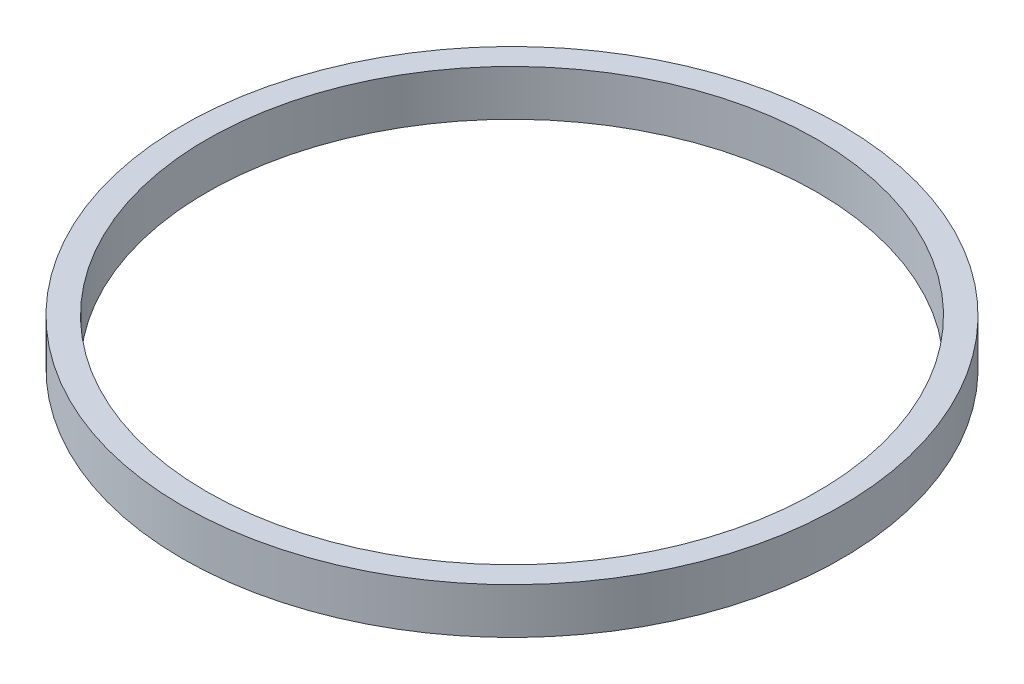
ISO-10303-21;
HEADER;
FILE_DESCRIPTION(('STEP AP214'),'2;1');
FILE_NAME('part.step','',(''),(''),'','','');
FILE_SCHEMA(('AUTOMOTIVE_DESIGN { 1 0 10303 214 1 1 1 1 }'));
ENDSEC;
DATA;
#1=APPLICATION_CONTEXT('core data for automotive mechanical design processes');
#2=APPLICATION_PROTOCOL_DEFINITION('international standard','automotive_design',2000,#1);
#3=PRODUCT_CONTEXT('',#1,'mechanical');
#4=PRODUCT('Part','Part','',(#3));
#5=PRODUCT_RELATED_PRODUCT_CATEGORY('part','',(#4));
#6=PRODUCT_DEFINITION_FORMATION('','',#4);
#7=PRODUCT_DEFINITION_CONTEXT('part definition',#1,'design');
#8=PRODUCT_DEFINITION('design','',#6,#7);
#9=PRODUCT_DEFINITION_SHAPE('','',#8);
#10=(LENGTH_UNIT() NAMED_UNIT(*) SI_UNIT(.MILLI.,.METRE.));
#11=(NAMED_UNIT(*) PLANE_ANGLE_UNIT() SI_UNIT($,.RADIAN.));
#12=(NAMED_UNIT(*) SI_UNIT($,.STERADIAN.) SOLID_ANGLE_UNIT());
#13=UNCERTAINTY_MEASURE_WITH_UNIT(LENGTH_MEASURE(1.E-05),#10,'distance_accuracy_value','');
#14=(GEOMETRIC_REPRESENTATION_CONTEXT(3) GLOBAL_UNCERTAINTY_ASSIGNED_CONTEXT((#13)) GLOBAL_UNIT_ASSIGNED_CONTEXT((#10,
#11,#12)) REPRESENTATION_CONTEXT('',''));
#15=CARTESIAN_POINT('',(0.,0.,0.));
#16=DIRECTION('',(0.,0.,1.));
#17=DIRECTION('',(1.,0.,0.));
#18=AXIS2_PLACEMENT_3D('',#15,#16,#17);
#19=CARTESIAN_POINT('',(-71.7105575326216,15.,-45.3553953625128));
#20=DIRECTION('',(0.,1.,0.));
#21=DIRECTION('',(0.,0.,1.));
#22=AXIS2_PLACEMENT_3D('',#19,#20,#21);
#23=PLANE('',#22);
#24=CARTESIAN_POINT('',(-71.7105575326216,15.,-45.3553953625128));
#25=DIRECTION('',(0.,1.,0.));
#26=DIRECTION('',(0.,0.,1.));
#27=AXIS2_PLACEMENT_3D('',#24,#25,#26);
#28=CIRCLE('',#27,108.);
#29=CARTESIAN_POINT('',(-71.7105575326216,15.,62.6446046374872));
#30=VERTEX_POINT('',#29);
#31=EDGE_CURVE('E10',#30,#30,#28,.T.);
#32=ORIENTED_EDGE('',*,*,#31,.T.);
#33=EDGE_LOOP('',(#32));
#34=FACE_BOUND('',#33,.T.);
#35=CARTESIAN_POINT('',(-71.7105575326216,15.,-45.3553953625128));
#36=DIRECTION('',(0.,1.,0.));
#37=DIRECTION('',(0.,0.,1.));
#38=AXIS2_PLACEMENT_3D('',#35,#36,#37);
#39=CIRCLE('',#38,100.);
#40=CARTESIAN_POINT('',(-71.7105575326216,15.,54.6446046374872));
#41=VERTEX_POINT('',#40);
#42=EDGE_CURVE('E45',#41,#41,#39,.T.);
#43=ORIENTED_EDGE('',*,*,#42,.F.);
#44=EDGE_LOOP('',(#43));
#45=FACE_BOUND('',#44,.T.);
#46=ADVANCED_FACE('F34',(#34,#45),#23,.T.);
#47=CARTESIAN_POINT('',(-71.7105575326216,0.,-45.3553953625128));
#48=DIRECTION('',(0.,1.,0.));
#49=DIRECTION('',(0.,0.,1.));
#50=AXIS2_PLACEMENT_3D('',#47,#48,#49);
#51=PLANE('',#50);
#52=CARTESIAN_POINT('',(-71.7105575326216,0.,-45.3553953625128));
#53=DIRECTION('',(0.,1.,0.));
#54=DIRECTION('',(0.,0.,1.));
#55=AXIS2_PLACEMENT_3D('',#52,#53,#54);
#56=CIRCLE('',#55,108.);
#57=CARTESIAN_POINT('',(-71.7105575326216,0.,62.6446046374872));
#58=VERTEX_POINT('',#57);
#59=EDGE_CURVE('E38',#58,#58,#56,.T.);
#60=ORIENTED_EDGE('',*,*,#59,.F.);
#61=EDGE_LOOP('',(#60));
#62=FACE_BOUND('',#61,.T.);
#63=CARTESIAN_POINT('',(-71.7105575326216,0.,-45.3553953625128));
#64=DIRECTION('',(0.,1.,0.));
#65=DIRECTION('',(0.,0.,1.));
#66=AXIS2_PLACEMENT_3D('',#63,#64,#65);
#67=CIRCLE('',#66,100.);
#68=CARTESIAN_POINT('',(-71.7105575326216,0.,54.6446046374872));
#69=VERTEX_POINT('',#68);
#70=EDGE_CURVE('E47',#69,#69,#67,.T.);
#71=ORIENTED_EDGE('',*,*,#70,.T.);
#72=EDGE_LOOP('',(#71));
#73=FACE_BOUND('',#72,.T.);
#74=ADVANCED_FACE('F57',(#62,#73),#51,.F.);
#75=CARTESIAN_POINT('',(-71.7105575326216,15.,-45.3553953625128));
#76=DIRECTION('',(0.,-1.,0.));
#77=DIRECTION('',(0.,0.,-1.));
#78=AXIS2_PLACEMENT_3D('',#75,#76,#77);
#79=CYLINDRICAL_SURFACE('',#78,108.);
#80=ORIENTED_EDGE('',*,*,#31,.F.);
#81=EDGE_LOOP('',(#80));
#82=FACE_BOUND('',#81,.T.);
#83=ORIENTED_EDGE('',*,*,#59,.T.);
#84=EDGE_LOOP('',(#83));
#85=FACE_BOUND('',#84,.T.);
#86=ADVANCED_FACE('F36',(#82,#85),#79,.T.);
#87=CARTESIAN_POINT('',(-71.7105575326216,15.,-45.3553953625128));
#88=DIRECTION('',(0.,-1.,0.));
#89=DIRECTION('',(0.,0.,-1.));
#90=AXIS2_PLACEMENT_3D('',#87,#88,#89);
#91=CYLINDRICAL_SURFACE('',#90,100.);
#92=ORIENTED_EDGE('',*,*,#42,.T.);
#93=EDGE_LOOP('',(#92));
#94=FACE_BOUND('',#93,.T.);
#95=ORIENTED_EDGE('',*,*,#70,.F.);
#96=EDGE_LOOP('',(#95));
#97=FACE_BOUND('',#96,.T.);
#98=ADVANCED_FACE('F53',(#94,#97),#91,.F.);
#99=CLOSED_SHELL('',(#46,#74,#86,#98));
#100=MANIFOLD_SOLID_BREP('B2',#99);
#101=ADVANCED_BREP_SHAPE_REPRESENTATION('',(#18,#100),#14);
#102=SHAPE_DEFINITION_REPRESENTATION(#9,#101);
ENDSEC;
END-ISO-10303-21;
